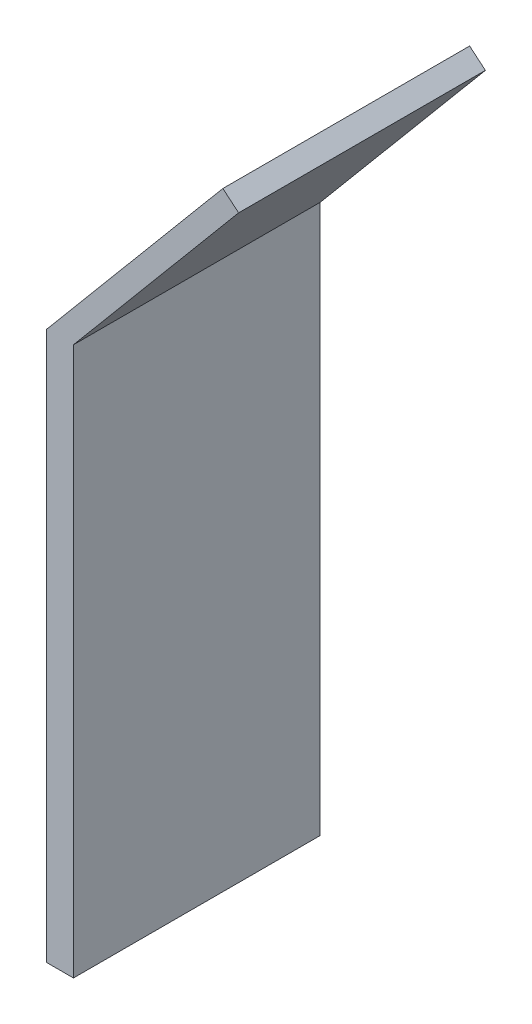
ISO-10303-21;
HEADER;
FILE_DESCRIPTION(('STEP AP214'),'2;1');
FILE_NAME('part.step','',(''),(''),'','','');
FILE_SCHEMA(('AUTOMOTIVE_DESIGN { 1 0 10303 214 1 1 1 1 }'));
ENDSEC;
DATA;
#1=APPLICATION_CONTEXT('core data for automotive mechanical design processes');
#2=APPLICATION_PROTOCOL_DEFINITION('international standard','automotive_design',2000,#1);
#3=PRODUCT_CONTEXT('',#1,'mechanical');
#4=PRODUCT('Part','Part','',(#3));
#5=PRODUCT_RELATED_PRODUCT_CATEGORY('part','',(#4));
#6=PRODUCT_DEFINITION_FORMATION('','',#4);
#7=PRODUCT_DEFINITION_CONTEXT('part definition',#1,'design');
#8=PRODUCT_DEFINITION('design','',#6,#7);
#9=PRODUCT_DEFINITION_SHAPE('','',#8);
#10=(LENGTH_UNIT() NAMED_UNIT(*) SI_UNIT(.MILLI.,.METRE.));
#11=(NAMED_UNIT(*) PLANE_ANGLE_UNIT() SI_UNIT($,.RADIAN.));
#12=(NAMED_UNIT(*) SI_UNIT($,.STERADIAN.) SOLID_ANGLE_UNIT());
#13=UNCERTAINTY_MEASURE_WITH_UNIT(LENGTH_MEASURE(1.E-05),#10,'distance_accuracy_value','');
#14=(GEOMETRIC_REPRESENTATION_CONTEXT(3) GLOBAL_UNCERTAINTY_ASSIGNED_CONTEXT((#13)) GLOBAL_UNIT_ASSIGNED_CONTEXT((#10,
#11,#12)) REPRESENTATION_CONTEXT('',''));
#15=CARTESIAN_POINT('',(0.,0.,0.));
#16=DIRECTION('',(0.,0.,1.));
#17=DIRECTION('',(1.,0.,0.));
#18=AXIS2_PLACEMENT_3D('',#15,#16,#17);
#19=CARTESIAN_POINT('',(3.91622186799683,0.,-18.));
#20=DIRECTION('',(0.,-1.,0.));
#21=DIRECTION('',(1.,0.,0.));
#22=AXIS2_PLACEMENT_3D('',#19,#20,#21);
#23=PLANE('',#22);
#24=DIRECTION('',(0.,0.,1.));
#25=VECTOR('',#24,1.);
#26=CARTESIAN_POINT('',(3.91622186799683,0.,-18.));
#27=LINE('',#26,#25);
#28=CARTESIAN_POINT('',(3.91622186799683,0.,-18.));
#29=VERTEX_POINT('',#28);
#30=CARTESIAN_POINT('',(3.91622186799683,0.,18.));
#31=VERTEX_POINT('',#30);
#32=EDGE_CURVE('E40',#29,#31,#27,.T.);
#33=ORIENTED_EDGE('',*,*,#32,.T.);
#34=DIRECTION('',(1.,0.,0.));
#35=VECTOR('',#34,1.);
#36=CARTESIAN_POINT('',(3.91622186799683,0.,18.));
#37=LINE('',#36,#35);
#38=CARTESIAN_POINT('',(0.,0.,18.));
#39=VERTEX_POINT('',#38);
#40=EDGE_CURVE('E89',#39,#31,#37,.T.);
#41=ORIENTED_EDGE('',*,*,#40,.F.);
#42=DIRECTION('',(0.,0.,1.));
#43=VECTOR('',#42,1.);
#44=CARTESIAN_POINT('',(0.,0.,-18.));
#45=LINE('',#44,#43);
#46=CARTESIAN_POINT('',(0.,0.,-18.));
#47=VERTEX_POINT('',#46);
#48=EDGE_CURVE('E11',#47,#39,#45,.T.);
#49=ORIENTED_EDGE('',*,*,#48,.F.);
#50=DIRECTION('',(1.,0.,0.));
#51=VECTOR('',#50,1.);
#52=CARTESIAN_POINT('',(3.91622186799683,0.,-18.));
#53=LINE('',#52,#51);
#54=EDGE_CURVE('E90',#47,#29,#53,.T.);
#55=ORIENTED_EDGE('',*,*,#54,.T.);
#56=EDGE_LOOP('',(#33,#41,#49,#55));
#57=FACE_BOUND('',#56,.T.);
#58=ADVANCED_FACE('F37',(#57),#23,.T.);
#59=CARTESIAN_POINT('',(0.,0.,-18.));
#60=DIRECTION('',(-1.,0.,0.));
#61=DIRECTION('',(0.,0.,1.));
#62=AXIS2_PLACEMENT_3D('',#59,#60,#61);
#63=PLANE('',#62);
#64=ORIENTED_EDGE('',*,*,#48,.T.);
#65=DIRECTION('',(0.,-1.,0.));
#66=VECTOR('',#65,1.);
#67=CARTESIAN_POINT('',(0.,0.,18.));
#68=LINE('',#67,#66);
#69=CARTESIAN_POINT('',(0.,80.,18.));
#70=VERTEX_POINT('',#69);
#71=EDGE_CURVE('E107',#70,#39,#68,.T.);
#72=ORIENTED_EDGE('',*,*,#71,.F.);
#73=DIRECTION('',(0.,0.,1.));
#74=VECTOR('',#73,1.);
#75=CARTESIAN_POINT('',(0.,80.,-18.));
#76=LINE('',#75,#74);
#77=CARTESIAN_POINT('',(0.,80.,-18.));
#78=VERTEX_POINT('',#77);
#79=EDGE_CURVE('E45',#78,#70,#76,.T.);
#80=ORIENTED_EDGE('',*,*,#79,.F.);
#81=DIRECTION('',(0.,-1.,0.));
#82=VECTOR('',#81,1.);
#83=CARTESIAN_POINT('',(0.,0.,-18.));
#84=LINE('',#83,#82);
#85=EDGE_CURVE('E95',#78,#47,#84,.T.);
#86=ORIENTED_EDGE('',*,*,#85,.T.);
#87=EDGE_LOOP('',(#64,#72,#80,#86));
#88=FACE_BOUND('',#87,.T.);
#89=ADVANCED_FACE('F147',(#88),#63,.T.);
#90=CARTESIAN_POINT('',(0.,80.,-18.));
#91=DIRECTION('',(-0.766044443118979,0.642787609686538,0.));
#92=DIRECTION('',(-0.642787609686538,-0.766044443118979,0.));
#93=AXIS2_PLACEMENT_3D('',#90,#91,#92);
#94=PLANE('',#93);
#95=ORIENTED_EDGE('',*,*,#79,.T.);
#96=DIRECTION('',(-0.642787609686538,-0.766044443118979,0.));
#97=VECTOR('',#96,1.);
#98=CARTESIAN_POINT('',(0.,80.,18.));
#99=LINE('',#98,#97);
#100=CARTESIAN_POINT('',(25.7115043874615,110.641777724759,18.));
#101=VERTEX_POINT('',#100);
#102=EDGE_CURVE('E114',#101,#70,#99,.T.);
#103=ORIENTED_EDGE('',*,*,#102,.F.);
#104=DIRECTION('',(0.,0.,1.));
#105=VECTOR('',#104,1.);
#106=CARTESIAN_POINT('',(25.7115043874615,110.641777724759,-18.));
#107=LINE('',#106,#105);
#108=CARTESIAN_POINT('',(25.7115043874615,110.641777724759,-18.));
#109=VERTEX_POINT('',#108);
#110=EDGE_CURVE('E130',#109,#101,#107,.T.);
#111=ORIENTED_EDGE('',*,*,#110,.F.);
#112=DIRECTION('',(-0.642787609686538,-0.766044443118979,0.));
#113=VECTOR('',#112,1.);
#114=CARTESIAN_POINT('',(0.,80.,-18.));
#115=LINE('',#114,#113);
#116=EDGE_CURVE('E126',#109,#78,#115,.T.);
#117=ORIENTED_EDGE('',*,*,#116,.T.);
#118=EDGE_LOOP('',(#95,#103,#111,#117));
#119=FACE_BOUND('',#118,.T.);
#120=ADVANCED_FACE('F143',(#119),#94,.T.);
#121=CARTESIAN_POINT('',(25.7115043874615,110.641777724759,-18.));
#122=DIRECTION('',(0.642787609686538,0.766044443118979,0.));
#123=DIRECTION('',(-0.766044443118979,0.642787609686538,0.));
#124=AXIS2_PLACEMENT_3D('',#121,#122,#123);
#125=PLANE('',#124);
#126=ORIENTED_EDGE('',*,*,#110,.T.);
#127=DIRECTION('',(-0.766044443118979,0.642787609686538,0.));
#128=VECTOR('',#127,1.);
#129=CARTESIAN_POINT('',(25.7115043874615,110.641777724759,18.));
#130=LINE('',#129,#128);
#131=CARTESIAN_POINT('',(28.0096377168185,108.7134148957,18.));
#132=VERTEX_POINT('',#131);
#133=EDGE_CURVE('E111',#132,#101,#130,.T.);
#134=ORIENTED_EDGE('',*,*,#133,.F.);
#135=DIRECTION('',(0.,0.,1.));
#136=VECTOR('',#135,1.);
#137=CARTESIAN_POINT('',(28.0096377168185,108.7134148957,-18.));
#138=LINE('',#137,#136);
#139=CARTESIAN_POINT('',(28.0096377168185,108.7134148957,-18.));
#140=VERTEX_POINT('',#139);
#141=EDGE_CURVE('E132',#140,#132,#138,.T.);
#142=ORIENTED_EDGE('',*,*,#141,.F.);
#143=DIRECTION('',(-0.766044443118979,0.642787609686538,0.));
#144=VECTOR('',#143,1.);
#145=CARTESIAN_POINT('',(25.7115043874615,110.641777724759,-18.));
#146=LINE('',#145,#144);
#147=EDGE_CURVE('E123',#140,#109,#146,.T.);
#148=ORIENTED_EDGE('',*,*,#147,.T.);
#149=EDGE_LOOP('',(#126,#134,#142,#148));
#150=FACE_BOUND('',#149,.T.);
#151=ADVANCED_FACE('F140',(#150),#125,.T.);
#152=CARTESIAN_POINT('',(28.0096377168185,108.7134148957,-18.));
#153=DIRECTION('',(0.766044443118979,-0.642787609686538,0.));
#154=DIRECTION('',(0.642787609686538,0.766044443118979,0.));
#155=AXIS2_PLACEMENT_3D('',#152,#153,#154);
#156=PLANE('',#155);
#157=ORIENTED_EDGE('',*,*,#141,.T.);
#158=DIRECTION('',(0.642787609686538,0.766044443118979,0.));
#159=VECTOR('',#158,1.);
#160=CARTESIAN_POINT('',(28.0096377168185,108.7134148957,18.));
#161=LINE('',#160,#159);
#162=CARTESIAN_POINT('',(3.91622186799683,80.,18.));
#163=VERTEX_POINT('',#162);
#164=EDGE_CURVE('E102',#163,#132,#161,.T.);
#165=ORIENTED_EDGE('',*,*,#164,.F.);
#166=DIRECTION('',(0.,0.,1.));
#167=VECTOR('',#166,1.);
#168=CARTESIAN_POINT('',(3.91622186799683,80.,-18.));
#169=LINE('',#168,#167);
#170=CARTESIAN_POINT('',(3.91622186799683,80.,-18.));
#171=VERTEX_POINT('',#170);
#172=EDGE_CURVE('E94',#171,#163,#169,.T.);
#173=ORIENTED_EDGE('',*,*,#172,.F.);
#174=DIRECTION('',(0.642787609686538,0.766044443118979,0.));
#175=VECTOR('',#174,1.);
#176=CARTESIAN_POINT('',(28.0096377168185,108.7134148957,-18.));
#177=LINE('',#176,#175);
#178=EDGE_CURVE('E120',#171,#140,#177,.T.);
#179=ORIENTED_EDGE('',*,*,#178,.T.);
#180=EDGE_LOOP('',(#157,#165,#173,#179));
#181=FACE_BOUND('',#180,.T.);
#182=ADVANCED_FACE('F134',(#181),#156,.T.);
#183=CARTESIAN_POINT('',(3.91622186799683,80.,-18.));
#184=DIRECTION('',(1.,0.,0.));
#185=DIRECTION('',(0.,1.,0.));
#186=AXIS2_PLACEMENT_3D('',#183,#184,#185);
#187=PLANE('',#186);
#188=ORIENTED_EDGE('',*,*,#172,.T.);
#189=DIRECTION('',(0.,1.,0.));
#190=VECTOR('',#189,1.);
#191=CARTESIAN_POINT('',(3.91622186799683,80.,18.));
#192=LINE('',#191,#190);
#193=EDGE_CURVE('E97',#31,#163,#192,.T.);
#194=ORIENTED_EDGE('',*,*,#193,.F.);
#195=ORIENTED_EDGE('',*,*,#32,.F.);
#196=DIRECTION('',(0.,1.,0.));
#197=VECTOR('',#196,1.);
#198=CARTESIAN_POINT('',(3.91622186799683,80.,-18.));
#199=LINE('',#198,#197);
#200=EDGE_CURVE('E118',#29,#171,#199,.T.);
#201=ORIENTED_EDGE('',*,*,#200,.T.);
#202=EDGE_LOOP('',(#188,#194,#195,#201));
#203=FACE_BOUND('',#202,.T.);
#204=ADVANCED_FACE('F98',(#203),#187,.T.);
#205=CARTESIAN_POINT('',(0.,0.,-18.));
#206=DIRECTION('',(0.,0.,-1.));
#207=DIRECTION('',(-1.,0.,0.));
#208=AXIS2_PLACEMENT_3D('',#205,#206,#207);
#209=PLANE('',#208);
#210=ORIENTED_EDGE('',*,*,#54,.F.);
#211=ORIENTED_EDGE('',*,*,#85,.F.);
#212=ORIENTED_EDGE('',*,*,#116,.F.);
#213=ORIENTED_EDGE('',*,*,#147,.F.);
#214=ORIENTED_EDGE('',*,*,#178,.F.);
#215=ORIENTED_EDGE('',*,*,#200,.F.);
#216=EDGE_LOOP('',(#210,#211,#212,#213,#214,#215));
#217=FACE_BOUND('',#216,.T.);
#218=ADVANCED_FACE('F146',(#217),#209,.T.);
#219=CARTESIAN_POINT('',(0.,0.,18.));
#220=DIRECTION('',(0.,0.,-1.));
#221=DIRECTION('',(-1.,0.,0.));
#222=AXIS2_PLACEMENT_3D('',#219,#220,#221);
#223=PLANE('',#222);
#224=ORIENTED_EDGE('',*,*,#40,.T.);
#225=ORIENTED_EDGE('',*,*,#193,.T.);
#226=ORIENTED_EDGE('',*,*,#164,.T.);
#227=ORIENTED_EDGE('',*,*,#133,.T.);
#228=ORIENTED_EDGE('',*,*,#102,.T.);
#229=ORIENTED_EDGE('',*,*,#71,.T.);
#230=EDGE_LOOP('',(#224,#225,#226,#227,#228,#229));
#231=FACE_BOUND('',#230,.T.);
#232=ADVANCED_FACE('F105',(#231),#223,.F.);
#233=CLOSED_SHELL('',(#58,#89,#120,#151,#182,#204,#218,#232));
#234=MANIFOLD_SOLID_BREP('B2',#233);
#235=ADVANCED_BREP_SHAPE_REPRESENTATION('',(#18,#234),#14);
#236=SHAPE_DEFINITION_REPRESENTATION(#9,#235);
ENDSEC;
END-ISO-10303-21;
